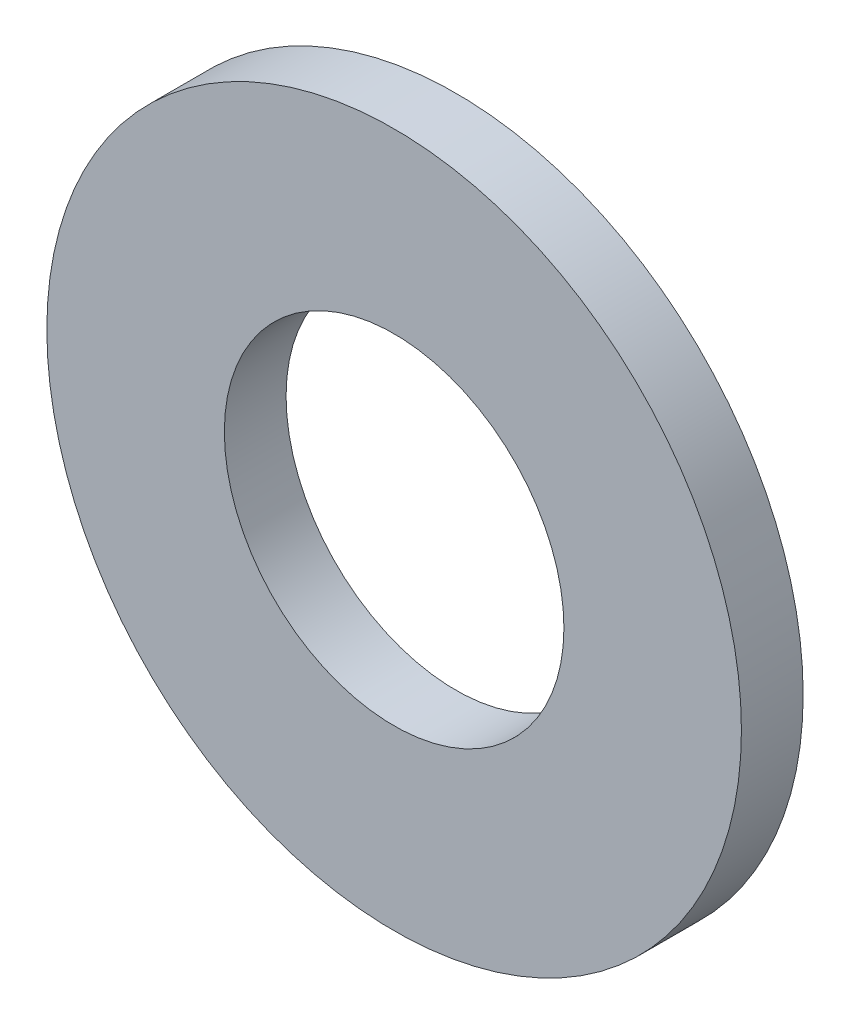
ISO-10303-21;
HEADER;
FILE_DESCRIPTION(('STEP AP214'),'2;1');
FILE_NAME('part.step','',(''),(''),'','','');
FILE_SCHEMA(('AUTOMOTIVE_DESIGN { 1 0 10303 214 1 1 1 1 }'));
ENDSEC;
DATA;
#1=APPLICATION_CONTEXT('core data for automotive mechanical design processes');
#2=APPLICATION_PROTOCOL_DEFINITION('international standard','automotive_design',2000,#1);
#3=PRODUCT_CONTEXT('',#1,'mechanical');
#4=PRODUCT('Part','Part','',(#3));
#5=PRODUCT_RELATED_PRODUCT_CATEGORY('part','',(#4));
#6=PRODUCT_DEFINITION_FORMATION('','',#4);
#7=PRODUCT_DEFINITION_CONTEXT('part definition',#1,'design');
#8=PRODUCT_DEFINITION('design','',#6,#7);
#9=PRODUCT_DEFINITION_SHAPE('','',#8);
#10=(LENGTH_UNIT() NAMED_UNIT(*) SI_UNIT(.MILLI.,.METRE.));
#11=(NAMED_UNIT(*) PLANE_ANGLE_UNIT() SI_UNIT($,.RADIAN.));
#12=(NAMED_UNIT(*) SI_UNIT($,.STERADIAN.) SOLID_ANGLE_UNIT());
#13=UNCERTAINTY_MEASURE_WITH_UNIT(LENGTH_MEASURE(1.E-05),#10,'distance_accuracy_value','');
#14=(GEOMETRIC_REPRESENTATION_CONTEXT(3) GLOBAL_UNCERTAINTY_ASSIGNED_CONTEXT((#13)) GLOBAL_UNIT_ASSIGNED_CONTEXT((#10,
#11,#12)) REPRESENTATION_CONTEXT('',''));
#15=CARTESIAN_POINT('',(0.,0.,0.));
#16=DIRECTION('',(0.,0.,1.));
#17=DIRECTION('',(1.,0.,0.));
#18=AXIS2_PLACEMENT_3D('',#15,#16,#17);
#19=CARTESIAN_POINT('',(0.,0.,0.4));
#20=DIRECTION('',(0.,0.,1.));
#21=DIRECTION('',(1.,0.,0.));
#22=AXIS2_PLACEMENT_3D('',#19,#20,#21);
#23=PLANE('',#22);
#24=CARTESIAN_POINT('',(0.,0.,0.4));
#25=DIRECTION('',(0.,0.,1.));
#26=DIRECTION('',(1.,0.,0.));
#27=AXIS2_PLACEMENT_3D('',#24,#25,#26);
#28=CIRCLE('',#27,2.25);
#29=CARTESIAN_POINT('',(2.25,0.,0.4));
#30=VERTEX_POINT('',#29);
#31=EDGE_CURVE('E10',#30,#30,#28,.T.);
#32=ORIENTED_EDGE('',*,*,#31,.T.);
#33=EDGE_LOOP('',(#32));
#34=FACE_BOUND('',#33,.T.);
#35=CARTESIAN_POINT('',(0.,0.,0.4));
#36=DIRECTION('',(0.,0.,1.));
#37=DIRECTION('',(1.,0.,0.));
#38=AXIS2_PLACEMENT_3D('',#35,#36,#37);
#39=CIRCLE('',#38,1.1);
#40=CARTESIAN_POINT('',(1.1,0.,0.4));
#41=VERTEX_POINT('',#40);
#42=EDGE_CURVE('E41',#41,#41,#39,.T.);
#43=ORIENTED_EDGE('',*,*,#42,.F.);
#44=EDGE_LOOP('',(#43));
#45=FACE_BOUND('',#44,.T.);
#46=ADVANCED_FACE('F30',(#34,#45),#23,.T.);
#47=CARTESIAN_POINT('',(0.,0.,0.));
#48=DIRECTION('',(0.,0.,1.));
#49=DIRECTION('',(1.,0.,0.));
#50=AXIS2_PLACEMENT_3D('',#47,#48,#49);
#51=PLANE('',#50);
#52=CARTESIAN_POINT('',(0.,0.,0.));
#53=DIRECTION('',(0.,0.,1.));
#54=DIRECTION('',(1.,0.,0.));
#55=AXIS2_PLACEMENT_3D('',#52,#53,#54);
#56=CIRCLE('',#55,2.25);
#57=CARTESIAN_POINT('',(2.25,0.,0.));
#58=VERTEX_POINT('',#57);
#59=EDGE_CURVE('E34',#58,#58,#56,.T.);
#60=ORIENTED_EDGE('',*,*,#59,.F.);
#61=EDGE_LOOP('',(#60));
#62=FACE_BOUND('',#61,.T.);
#63=CARTESIAN_POINT('',(0.,0.,0.));
#64=DIRECTION('',(0.,0.,1.));
#65=DIRECTION('',(1.,0.,0.));
#66=AXIS2_PLACEMENT_3D('',#63,#64,#65);
#67=CIRCLE('',#66,1.1);
#68=CARTESIAN_POINT('',(1.1,0.,0.));
#69=VERTEX_POINT('',#68);
#70=EDGE_CURVE('E43',#69,#69,#67,.T.);
#71=ORIENTED_EDGE('',*,*,#70,.T.);
#72=EDGE_LOOP('',(#71));
#73=FACE_BOUND('',#72,.T.);
#74=ADVANCED_FACE('F53',(#62,#73),#51,.F.);
#75=CARTESIAN_POINT('',(0.,0.,0.4));
#76=DIRECTION('',(0.,0.,-1.));
#77=DIRECTION('',(-1.,0.,0.));
#78=AXIS2_PLACEMENT_3D('',#75,#76,#77);
#79=CYLINDRICAL_SURFACE('',#78,2.25);
#80=ORIENTED_EDGE('',*,*,#31,.F.);
#81=EDGE_LOOP('',(#80));
#82=FACE_BOUND('',#81,.T.);
#83=ORIENTED_EDGE('',*,*,#59,.T.);
#84=EDGE_LOOP('',(#83));
#85=FACE_BOUND('',#84,.T.);
#86=ADVANCED_FACE('F32',(#82,#85),#79,.T.);
#87=CARTESIAN_POINT('',(0.,0.,0.4));
#88=DIRECTION('',(0.,0.,-1.));
#89=DIRECTION('',(-1.,0.,0.));
#90=AXIS2_PLACEMENT_3D('',#87,#88,#89);
#91=CYLINDRICAL_SURFACE('',#90,1.1);
#92=ORIENTED_EDGE('',*,*,#42,.T.);
#93=EDGE_LOOP('',(#92));
#94=FACE_BOUND('',#93,.T.);
#95=ORIENTED_EDGE('',*,*,#70,.F.);
#96=EDGE_LOOP('',(#95));
#97=FACE_BOUND('',#96,.T.);
#98=ADVANCED_FACE('F49',(#94,#97),#91,.F.);
#99=CLOSED_SHELL('',(#46,#74,#86,#98));
#100=MANIFOLD_SOLID_BREP('B2',#99);
#101=ADVANCED_BREP_SHAPE_REPRESENTATION('',(#18,#100),#14);
#102=SHAPE_DEFINITION_REPRESENTATION(#9,#101);
ENDSEC;
END-ISO-10303-21;
